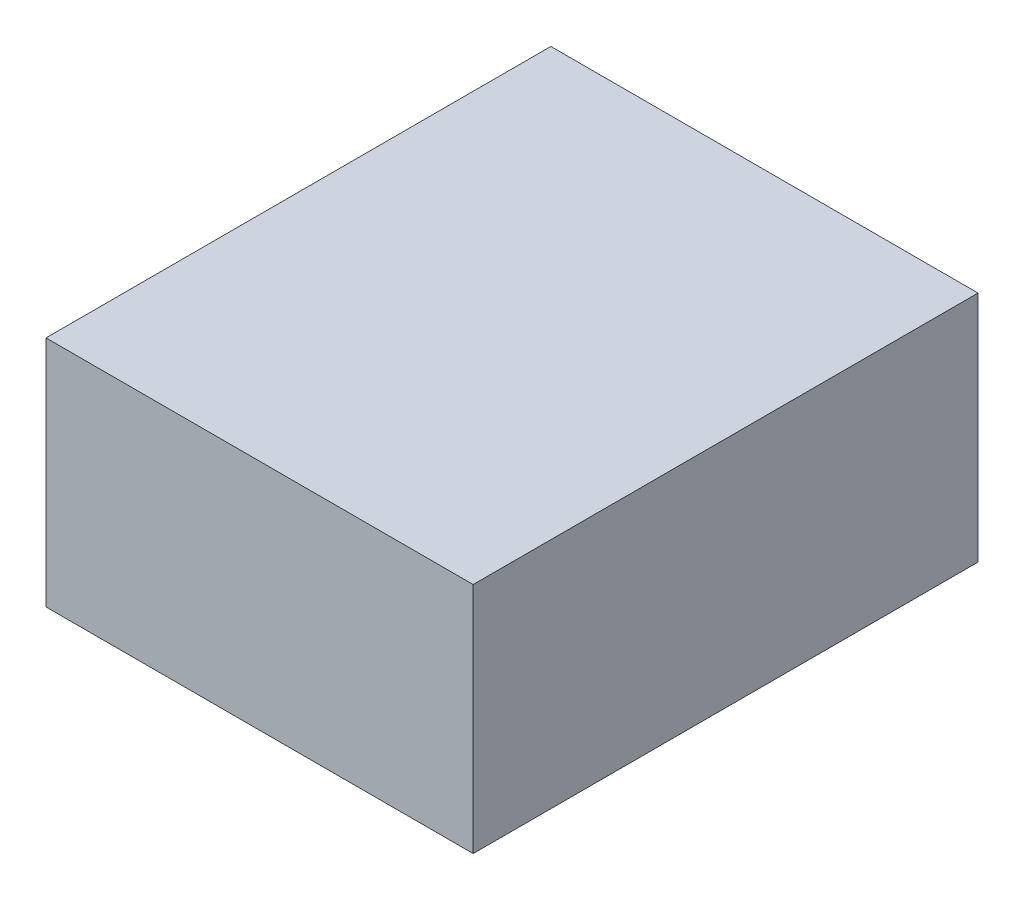
ISO-10303-21;
HEADER;
FILE_DESCRIPTION(('STEP AP214'),'2;1');
FILE_NAME('part.step','',(''),(''),'','','');
FILE_SCHEMA(('AUTOMOTIVE_DESIGN { 1 0 10303 214 1 1 1 1 }'));
ENDSEC;
DATA;
#1=APPLICATION_CONTEXT('core data for automotive mechanical design processes');
#2=APPLICATION_PROTOCOL_DEFINITION('international standard','automotive_design',2000,#1);
#3=PRODUCT_CONTEXT('',#1,'mechanical');
#4=PRODUCT('Part','Part','',(#3));
#5=PRODUCT_RELATED_PRODUCT_CATEGORY('part','',(#4));
#6=PRODUCT_DEFINITION_FORMATION('','',#4);
#7=PRODUCT_DEFINITION_CONTEXT('part definition',#1,'design');
#8=PRODUCT_DEFINITION('design','',#6,#7);
#9=PRODUCT_DEFINITION_SHAPE('','',#8);
#10=(LENGTH_UNIT() NAMED_UNIT(*) SI_UNIT(.MILLI.,.METRE.));
#11=(NAMED_UNIT(*) PLANE_ANGLE_UNIT() SI_UNIT($,.RADIAN.));
#12=(NAMED_UNIT(*) SI_UNIT($,.STERADIAN.) SOLID_ANGLE_UNIT());
#13=UNCERTAINTY_MEASURE_WITH_UNIT(LENGTH_MEASURE(1.E-05),#10,'distance_accuracy_value','');
#14=(GEOMETRIC_REPRESENTATION_CONTEXT(3) GLOBAL_UNCERTAINTY_ASSIGNED_CONTEXT((#13)) GLOBAL_UNIT_ASSIGNED_CONTEXT((#10,
#11,#12)) REPRESENTATION_CONTEXT('',''));
#15=CARTESIAN_POINT('',(0.,0.,0.));
#16=DIRECTION('',(0.,0.,1.));
#17=DIRECTION('',(1.,0.,0.));
#18=AXIS2_PLACEMENT_3D('',#15,#16,#17);
#19=CARTESIAN_POINT('',(-0.5499989,-0.2999994,0.));
#20=DIRECTION('',(0.,1.,0.));
#21=DIRECTION('',(0.,0.,1.));
#22=AXIS2_PLACEMENT_3D('',#19,#20,#21);
#23=PLANE('',#22);
#24=DIRECTION('',(0.,0.,1.));
#25=VECTOR('',#24,1.);
#26=CARTESIAN_POINT('',(0.5499989,-0.2999994,0.));
#27=LINE('',#26,#25);
#28=CARTESIAN_POINT('',(0.5499989,-0.2999994,0.));
#29=VERTEX_POINT('',#28);
#30=CARTESIAN_POINT('',(0.5499989,-0.2999994,1.29999994));
#31=VERTEX_POINT('',#30);
#32=EDGE_CURVE('E19',#29,#31,#27,.T.);
#33=ORIENTED_EDGE('',*,*,#32,.T.);
#34=DIRECTION('',(-1.,0.,0.));
#35=VECTOR('',#34,1.);
#36=CARTESIAN_POINT('',(0.5499989,-0.2999994,1.29999994));
#37=LINE('',#36,#35);
#38=CARTESIAN_POINT('',(-0.5499989,-0.2999994,1.29999994));
#39=VERTEX_POINT('',#38);
#40=EDGE_CURVE('E54',#31,#39,#37,.T.);
#41=ORIENTED_EDGE('',*,*,#40,.T.);
#42=DIRECTION('',(0.,0.,-1.));
#43=VECTOR('',#42,1.);
#44=CARTESIAN_POINT('',(-0.5499989,-0.2999994,0.));
#45=LINE('',#44,#43);
#46=CARTESIAN_POINT('',(-0.5499989,-0.2999994,0.));
#47=VERTEX_POINT('',#46);
#48=EDGE_CURVE('E75',#39,#47,#45,.T.);
#49=ORIENTED_EDGE('',*,*,#48,.T.);
#50=DIRECTION('',(-1.,0.,0.));
#51=VECTOR('',#50,1.);
#52=CARTESIAN_POINT('',(0.5499989,-0.2999994,0.));
#53=LINE('',#52,#51);
#54=EDGE_CURVE('E57',#29,#47,#53,.T.);
#55=ORIENTED_EDGE('',*,*,#54,.F.);
#56=EDGE_LOOP('',(#33,#41,#49,#55));
#57=FACE_BOUND('',#56,.T.);
#58=ADVANCED_FACE('F16',(#57),#23,.F.);
#59=CARTESIAN_POINT('',(0.5499989,-0.2999994,0.));
#60=DIRECTION('',(-1.,0.,0.));
#61=DIRECTION('',(0.,0.,1.));
#62=AXIS2_PLACEMENT_3D('',#59,#60,#61);
#63=PLANE('',#62);
#64=DIRECTION('',(0.,0.,-1.));
#65=VECTOR('',#64,1.);
#66=CARTESIAN_POINT('',(0.5499989,0.2999994,0.));
#67=LINE('',#66,#65);
#68=CARTESIAN_POINT('',(0.5499989,0.2999994,0.));
#69=VERTEX_POINT('',#68);
#70=CARTESIAN_POINT('',(0.5499989,0.2999994,1.29999994));
#71=VERTEX_POINT('',#70);
#72=EDGE_CURVE('E72',#69,#71,#67,.F.);
#73=ORIENTED_EDGE('',*,*,#72,.T.);
#74=DIRECTION('',(0.,1.,0.));
#75=VECTOR('',#74,1.);
#76=CARTESIAN_POINT('',(0.5499989,0.2999994,1.29999994));
#77=LINE('',#76,#75);
#78=EDGE_CURVE('E62',#71,#31,#77,.F.);
#79=ORIENTED_EDGE('',*,*,#78,.T.);
#80=ORIENTED_EDGE('',*,*,#32,.F.);
#81=DIRECTION('',(0.,1.,0.));
#82=VECTOR('',#81,1.);
#83=CARTESIAN_POINT('',(0.5499989,0.2999994,0.));
#84=LINE('',#83,#82);
#85=EDGE_CURVE('E77',#69,#29,#84,.F.);
#86=ORIENTED_EDGE('',*,*,#85,.F.);
#87=EDGE_LOOP('',(#73,#79,#80,#86));
#88=FACE_BOUND('',#87,.T.);
#89=ADVANCED_FACE('F71',(#88),#63,.F.);
#90=CARTESIAN_POINT('',(0.5499989,0.2999994,1.29999994));
#91=DIRECTION('',(0.,0.,-1.));
#92=DIRECTION('',(-1.,0.,0.));
#93=AXIS2_PLACEMENT_3D('',#90,#91,#92);
#94=PLANE('',#93);
#95=DIRECTION('',(0.,1.,0.));
#96=VECTOR('',#95,1.);
#97=CARTESIAN_POINT('',(-0.5499989,0.2999994,1.29999994));
#98=LINE('',#97,#96);
#99=CARTESIAN_POINT('',(-0.5499989,0.2999994,1.29999994));
#100=VERTEX_POINT('',#99);
#101=EDGE_CURVE('E68',#100,#39,#98,.F.);
#102=ORIENTED_EDGE('',*,*,#101,.T.);
#103=ORIENTED_EDGE('',*,*,#40,.F.);
#104=ORIENTED_EDGE('',*,*,#78,.F.);
#105=DIRECTION('',(1.,0.,0.));
#106=VECTOR('',#105,1.);
#107=CARTESIAN_POINT('',(0.5499989,0.2999994,1.29999994));
#108=LINE('',#107,#106);
#109=EDGE_CURVE('E82',#71,#100,#108,.F.);
#110=ORIENTED_EDGE('',*,*,#109,.T.);
#111=EDGE_LOOP('',(#102,#103,#104,#110));
#112=FACE_BOUND('',#111,.T.);
#113=ADVANCED_FACE('F65',(#112),#94,.F.);
#114=CARTESIAN_POINT('',(-0.5499989,0.2999994,0.));
#115=DIRECTION('',(1.,0.,0.));
#116=DIRECTION('',(0.,0.,-1.));
#117=AXIS2_PLACEMENT_3D('',#114,#115,#116);
#118=PLANE('',#117);
#119=ORIENTED_EDGE('',*,*,#48,.F.);
#120=ORIENTED_EDGE('',*,*,#101,.F.);
#121=DIRECTION('',(0.,0.,-1.));
#122=VECTOR('',#121,1.);
#123=CARTESIAN_POINT('',(-0.5499989,0.2999994,0.));
#124=LINE('',#123,#122);
#125=CARTESIAN_POINT('',(-0.5499989,0.2999994,0.));
#126=VERTEX_POINT('',#125);
#127=EDGE_CURVE('E25',#100,#126,#124,.T.);
#128=ORIENTED_EDGE('',*,*,#127,.T.);
#129=DIRECTION('',(0.,1.,0.));
#130=VECTOR('',#129,1.);
#131=CARTESIAN_POINT('',(-0.5499989,0.2999994,0.));
#132=LINE('',#131,#130);
#133=EDGE_CURVE('E33',#47,#126,#132,.T.);
#134=ORIENTED_EDGE('',*,*,#133,.F.);
#135=EDGE_LOOP('',(#119,#120,#128,#134));
#136=FACE_BOUND('',#135,.T.);
#137=ADVANCED_FACE('F87',(#136),#118,.F.);
#138=CARTESIAN_POINT('',(0.5499989,0.2999994,0.));
#139=DIRECTION('',(0.,0.,-1.));
#140=DIRECTION('',(-1.,0.,0.));
#141=AXIS2_PLACEMENT_3D('',#138,#139,#140);
#142=PLANE('',#141);
#143=ORIENTED_EDGE('',*,*,#133,.T.);
#144=DIRECTION('',(1.,0.,0.));
#145=VECTOR('',#144,1.);
#146=CARTESIAN_POINT('',(0.5499989,0.2999994,0.));
#147=LINE('',#146,#145);
#148=EDGE_CURVE('E11',#126,#69,#147,.T.);
#149=ORIENTED_EDGE('',*,*,#148,.T.);
#150=ORIENTED_EDGE('',*,*,#85,.T.);
#151=ORIENTED_EDGE('',*,*,#54,.T.);
#152=EDGE_LOOP('',(#143,#149,#150,#151));
#153=FACE_BOUND('',#152,.T.);
#154=ADVANCED_FACE('F90',(#153),#142,.T.);
#155=CARTESIAN_POINT('',(0.5499989,0.2999994,0.));
#156=DIRECTION('',(0.,-1.,0.));
#157=DIRECTION('',(0.,0.,-1.));
#158=AXIS2_PLACEMENT_3D('',#155,#156,#157);
#159=PLANE('',#158);
#160=ORIENTED_EDGE('',*,*,#127,.F.);
#161=ORIENTED_EDGE('',*,*,#109,.F.);
#162=ORIENTED_EDGE('',*,*,#72,.F.);
#163=ORIENTED_EDGE('',*,*,#148,.F.);
#164=EDGE_LOOP('',(#160,#161,#162,#163));
#165=FACE_BOUND('',#164,.T.);
#166=ADVANCED_FACE('F89',(#165),#159,.F.);
#167=CLOSED_SHELL('',(#58,#89,#113,#137,#154,#166));
#168=MANIFOLD_SOLID_BREP('B1',#167);
#169=ADVANCED_BREP_SHAPE_REPRESENTATION('',(#18,#168),#14);
#170=SHAPE_DEFINITION_REPRESENTATION(#9,#169);
ENDSEC;
END-ISO-10303-21;
